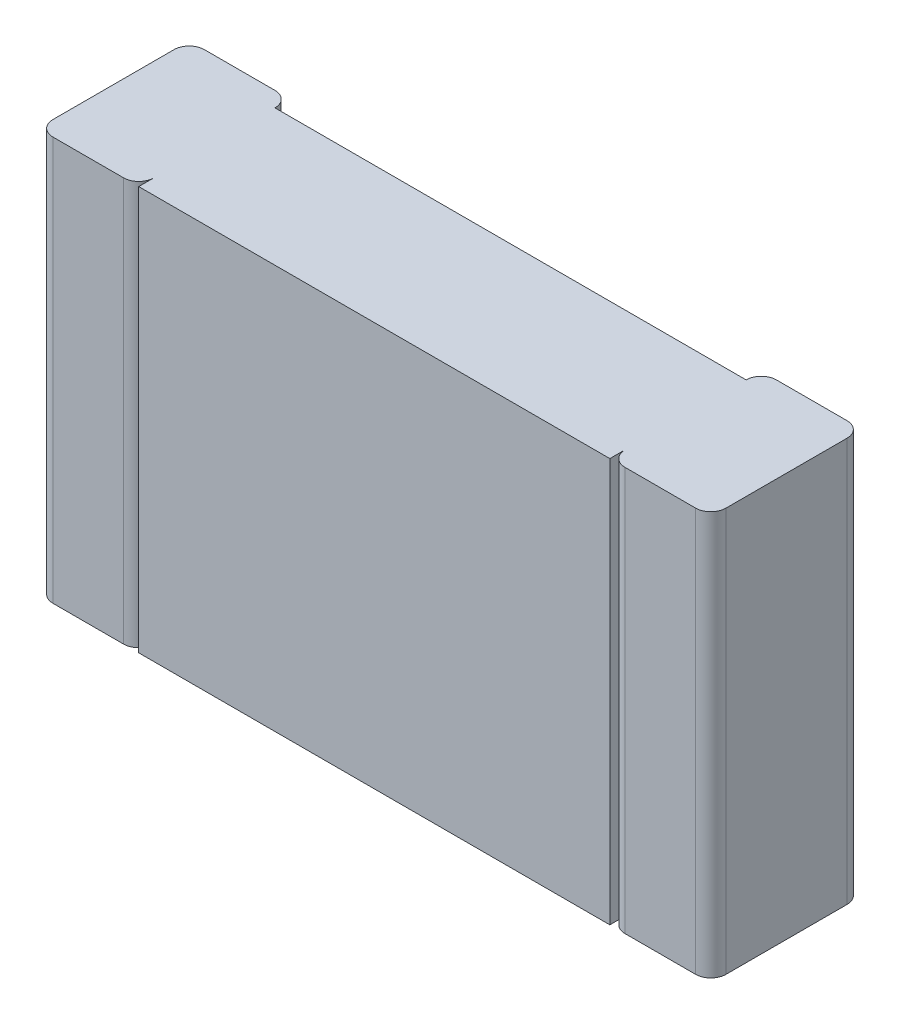
ISO-10303-21;
HEADER;
FILE_DESCRIPTION(('STEP AP214'),'2;1');
FILE_NAME('part.step','',(''),(''),'','','');
FILE_SCHEMA(('AUTOMOTIVE_DESIGN { 1 0 10303 214 1 1 1 1 }'));
ENDSEC;
DATA;
#1=APPLICATION_CONTEXT('core data for automotive mechanical design processes');
#2=APPLICATION_PROTOCOL_DEFINITION('international standard','automotive_design',2000,#1);
#3=PRODUCT_CONTEXT('',#1,'mechanical');
#4=PRODUCT('Part','Part','',(#3));
#5=PRODUCT_RELATED_PRODUCT_CATEGORY('part','',(#4));
#6=PRODUCT_DEFINITION_FORMATION('','',#4);
#7=PRODUCT_DEFINITION_CONTEXT('part definition',#1,'design');
#8=PRODUCT_DEFINITION('design','',#6,#7);
#9=PRODUCT_DEFINITION_SHAPE('','',#8);
#10=(LENGTH_UNIT() NAMED_UNIT(*) SI_UNIT(.MILLI.,.METRE.));
#11=(NAMED_UNIT(*) PLANE_ANGLE_UNIT() SI_UNIT($,.RADIAN.));
#12=(NAMED_UNIT(*) SI_UNIT($,.STERADIAN.) SOLID_ANGLE_UNIT());
#13=UNCERTAINTY_MEASURE_WITH_UNIT(LENGTH_MEASURE(1.E-05),#10,'distance_accuracy_value','');
#14=(GEOMETRIC_REPRESENTATION_CONTEXT(3) GLOBAL_UNCERTAINTY_ASSIGNED_CONTEXT((#13)) GLOBAL_UNIT_ASSIGNED_CONTEXT((#10,
#11,#12)) REPRESENTATION_CONTEXT('',''));
#15=CARTESIAN_POINT('',(0.,0.,0.));
#16=DIRECTION('',(0.,0.,1.));
#17=DIRECTION('',(1.,0.,0.));
#18=AXIS2_PLACEMENT_3D('',#15,#16,#17);
#19=CARTESIAN_POINT('',(-0.955,-0.6,0.045));
#20=DIRECTION('',(0.,1.,0.));
#21=DIRECTION('',(0.,0.,1.));
#22=AXIS2_PLACEMENT_3D('',#19,#20,#21);
#23=CYLINDRICAL_SURFACE('',#22,0.045);
#24=DIRECTION('',(0.,1.,0.));
#25=VECTOR('',#24,1.);
#26=CARTESIAN_POINT('',(-0.955,-0.6,0.));
#27=LINE('',#26,#25);
#28=CARTESIAN_POINT('',(-0.955,0.6,0.));
#29=VERTEX_POINT('',#28);
#30=CARTESIAN_POINT('',(-0.955,-0.6,0.));
#31=VERTEX_POINT('',#30);
#32=EDGE_CURVE('E129',#29,#31,#27,.F.);
#33=ORIENTED_EDGE('',*,*,#32,.T.);
#34=CARTESIAN_POINT('',(-0.955,-0.6,0.045));
#35=DIRECTION('',(0.,1.,0.));
#36=DIRECTION('',(0.,0.,1.));
#37=AXIS2_PLACEMENT_3D('',#34,#35,#36);
#38=CIRCLE('',#37,0.045);
#39=CARTESIAN_POINT('',(-1.,-0.6,0.045));
#40=VERTEX_POINT('',#39);
#41=EDGE_CURVE('E20',#31,#40,#38,.T.);
#42=ORIENTED_EDGE('',*,*,#41,.T.);
#43=DIRECTION('',(0.,1.,0.));
#44=VECTOR('',#43,1.);
#45=CARTESIAN_POINT('',(-1.,-0.6,0.045));
#46=LINE('',#45,#44);
#47=CARTESIAN_POINT('',(-1.,0.6,0.045));
#48=VERTEX_POINT('',#47);
#49=EDGE_CURVE('E136',#40,#48,#46,.T.);
#50=ORIENTED_EDGE('',*,*,#49,.T.);
#51=CARTESIAN_POINT('',(-0.955,0.6,0.045));
#52=DIRECTION('',(0.,1.,0.));
#53=DIRECTION('',(0.,0.,1.));
#54=AXIS2_PLACEMENT_3D('',#51,#52,#53);
#55=CIRCLE('',#54,0.045);
#56=EDGE_CURVE('E232',#29,#48,#55,.T.);
#57=ORIENTED_EDGE('',*,*,#56,.F.);
#58=EDGE_LOOP('',(#33,#42,#50,#57));
#59=FACE_BOUND('',#58,.T.);
#60=ADVANCED_FACE('F17',(#59),#23,.T.);
#61=CARTESIAN_POINT('',(-1.,-0.6,0.));
#62=DIRECTION('',(1.,0.,0.));
#63=DIRECTION('',(0.,0.,-1.));
#64=AXIS2_PLACEMENT_3D('',#61,#62,#63);
#65=PLANE('',#64);
#66=DIRECTION('',(0.,0.,1.));
#67=VECTOR('',#66,1.);
#68=CARTESIAN_POINT('',(-1.,0.6,0.));
#69=LINE('',#68,#67);
#70=CARTESIAN_POINT('',(-1.,0.6,0.405));
#71=VERTEX_POINT('',#70);
#72=EDGE_CURVE('E141',#48,#71,#69,.T.);
#73=ORIENTED_EDGE('',*,*,#72,.F.);
#74=ORIENTED_EDGE('',*,*,#49,.F.);
#75=DIRECTION('',(0.,0.,1.));
#76=VECTOR('',#75,1.);
#77=CARTESIAN_POINT('',(-1.,-0.6,0.));
#78=LINE('',#77,#76);
#79=CARTESIAN_POINT('',(-1.,-0.6,0.405));
#80=VERTEX_POINT('',#79);
#81=EDGE_CURVE('E140',#40,#80,#78,.T.);
#82=ORIENTED_EDGE('',*,*,#81,.T.);
#83=DIRECTION('',(0.,1.,0.));
#84=VECTOR('',#83,1.);
#85=CARTESIAN_POINT('',(-1.,-0.6,0.405));
#86=LINE('',#85,#84);
#87=EDGE_CURVE('E142',#71,#80,#86,.F.);
#88=ORIENTED_EDGE('',*,*,#87,.F.);
#89=EDGE_LOOP('',(#73,#74,#82,#88));
#90=FACE_BOUND('',#89,.T.);
#91=ADVANCED_FACE('F138',(#90),#65,.F.);
#92=CARTESIAN_POINT('',(-0.955,-0.6,0.405));
#93=DIRECTION('',(0.,1.,0.));
#94=DIRECTION('',(0.,0.,1.));
#95=AXIS2_PLACEMENT_3D('',#92,#93,#94);
#96=CYLINDRICAL_SURFACE('',#95,0.045);
#97=CARTESIAN_POINT('',(-0.955,0.6,0.405));
#98=DIRECTION('',(0.,1.,0.));
#99=DIRECTION('',(0.,0.,1.));
#100=AXIS2_PLACEMENT_3D('',#97,#98,#99);
#101=CIRCLE('',#100,0.045);
#102=CARTESIAN_POINT('',(-0.955,0.6,0.45));
#103=VERTEX_POINT('',#102);
#104=EDGE_CURVE('E230',#71,#103,#101,.T.);
#105=ORIENTED_EDGE('',*,*,#104,.F.);
#106=ORIENTED_EDGE('',*,*,#87,.T.);
#107=CARTESIAN_POINT('',(-0.955,-0.6,0.405));
#108=DIRECTION('',(0.,1.,0.));
#109=DIRECTION('',(0.,0.,1.));
#110=AXIS2_PLACEMENT_3D('',#107,#108,#109);
#111=CIRCLE('',#110,0.045);
#112=CARTESIAN_POINT('',(-0.955,-0.6,0.45));
#113=VERTEX_POINT('',#112);
#114=EDGE_CURVE('E151',#80,#113,#111,.T.);
#115=ORIENTED_EDGE('',*,*,#114,.T.);
#116=DIRECTION('',(0.,1.,0.));
#117=VECTOR('',#116,1.);
#118=CARTESIAN_POINT('',(-0.955,-0.6,0.45));
#119=LINE('',#118,#117);
#120=EDGE_CURVE('E200',#103,#113,#119,.F.);
#121=ORIENTED_EDGE('',*,*,#120,.F.);
#122=EDGE_LOOP('',(#105,#106,#115,#121));
#123=FACE_BOUND('',#122,.T.);
#124=ADVANCED_FACE('F456',(#123),#96,.T.);
#125=CARTESIAN_POINT('',(-1.,-0.6,0.45));
#126=DIRECTION('',(0.,0.,1.));
#127=DIRECTION('',(1.,0.,0.));
#128=AXIS2_PLACEMENT_3D('',#125,#126,#127);
#129=PLANE('',#128);
#130=DIRECTION('',(1.,0.,0.));
#131=VECTOR('',#130,1.);
#132=CARTESIAN_POINT('',(-1.,-0.6,0.45));
#133=LINE('',#132,#131);
#134=CARTESIAN_POINT('',(-0.745,-0.6,0.45));
#135=VERTEX_POINT('',#134);
#136=EDGE_CURVE('E248',#113,#135,#133,.T.);
#137=ORIENTED_EDGE('',*,*,#136,.T.);
#138=DIRECTION('',(0.,1.,0.));
#139=VECTOR('',#138,1.);
#140=CARTESIAN_POINT('',(-0.745,-0.6,0.45));
#141=LINE('',#140,#139);
#142=CARTESIAN_POINT('',(-0.745,0.6,0.45));
#143=VERTEX_POINT('',#142);
#144=EDGE_CURVE('E198',#143,#135,#141,.F.);
#145=ORIENTED_EDGE('',*,*,#144,.F.);
#146=DIRECTION('',(1.,0.,0.));
#147=VECTOR('',#146,1.);
#148=CARTESIAN_POINT('',(-1.,0.6,0.45));
#149=LINE('',#148,#147);
#150=EDGE_CURVE('E229',#103,#143,#149,.T.);
#151=ORIENTED_EDGE('',*,*,#150,.F.);
#152=ORIENTED_EDGE('',*,*,#120,.T.);
#153=EDGE_LOOP('',(#137,#145,#151,#152));
#154=FACE_BOUND('',#153,.T.);
#155=ADVANCED_FACE('F446',(#154),#129,.T.);
#156=CARTESIAN_POINT('',(-0.745,-0.6,0.405));
#157=DIRECTION('',(0.,1.,0.));
#158=DIRECTION('',(0.,0.,1.));
#159=AXIS2_PLACEMENT_3D('',#156,#157,#158);
#160=CYLINDRICAL_SURFACE('',#159,0.045);
#161=ORIENTED_EDGE('',*,*,#144,.T.);
#162=CARTESIAN_POINT('',(-0.745,-0.6,0.405));
#163=DIRECTION('',(0.,1.,0.));
#164=DIRECTION('',(0.,0.,1.));
#165=AXIS2_PLACEMENT_3D('',#162,#163,#164);
#166=CIRCLE('',#165,0.045);
#167=CARTESIAN_POINT('',(-0.7,-0.6,0.405));
#168=VERTEX_POINT('',#167);
#169=EDGE_CURVE('E246',#135,#168,#166,.T.);
#170=ORIENTED_EDGE('',*,*,#169,.T.);
#171=DIRECTION('',(0.,1.,0.));
#172=VECTOR('',#171,1.);
#173=CARTESIAN_POINT('',(-0.7,-0.6,0.405));
#174=LINE('',#173,#172);
#175=CARTESIAN_POINT('',(-0.7,0.6,0.405));
#176=VERTEX_POINT('',#175);
#177=EDGE_CURVE('E193',#168,#176,#174,.T.);
#178=ORIENTED_EDGE('',*,*,#177,.T.);
#179=CARTESIAN_POINT('',(-0.745,0.6,0.405));
#180=DIRECTION('',(0.,1.,0.));
#181=DIRECTION('',(0.,0.,1.));
#182=AXIS2_PLACEMENT_3D('',#179,#180,#181);
#183=CIRCLE('',#182,0.045);
#184=EDGE_CURVE('E227',#143,#176,#183,.T.);
#185=ORIENTED_EDGE('',*,*,#184,.F.);
#186=EDGE_LOOP('',(#161,#170,#178,#185));
#187=FACE_BOUND('',#186,.T.);
#188=ADVANCED_FACE('F434',(#187),#160,.T.);
#189=CARTESIAN_POINT('',(-0.7,-0.6,0.405));
#190=DIRECTION('',(1.,0.,0.));
#191=DIRECTION('',(0.,0.,-1.));
#192=AXIS2_PLACEMENT_3D('',#189,#190,#191);
#193=PLANE('',#192);
#194=DIRECTION('',(0.,0.,1.));
#195=VECTOR('',#194,1.);
#196=CARTESIAN_POINT('',(-0.7,0.6,0.405));
#197=LINE('',#196,#195);
#198=CARTESIAN_POINT('',(-0.7,0.6,0.45));
#199=VERTEX_POINT('',#198);
#200=EDGE_CURVE('E188',#176,#199,#197,.T.);
#201=ORIENTED_EDGE('',*,*,#200,.F.);
#202=ORIENTED_EDGE('',*,*,#177,.F.);
#203=DIRECTION('',(0.,0.,1.));
#204=VECTOR('',#203,1.);
#205=CARTESIAN_POINT('',(-0.7,-0.6,0.405));
#206=LINE('',#205,#204);
#207=CARTESIAN_POINT('',(-0.7,-0.6,0.45));
#208=VERTEX_POINT('',#207);
#209=EDGE_CURVE('E206',#168,#208,#206,.T.);
#210=ORIENTED_EDGE('',*,*,#209,.T.);
#211=DIRECTION('',(0.,1.,0.));
#212=VECTOR('',#211,1.);
#213=CARTESIAN_POINT('',(-0.7,-0.6,0.45));
#214=LINE('',#213,#212);
#215=EDGE_CURVE('E181',#199,#208,#214,.F.);
#216=ORIENTED_EDGE('',*,*,#215,.F.);
#217=EDGE_LOOP('',(#201,#202,#210,#216));
#218=FACE_BOUND('',#217,.T.);
#219=ADVANCED_FACE('F424',(#218),#193,.F.);
#220=CARTESIAN_POINT('',(-0.7,-0.6,0.45));
#221=DIRECTION('',(0.,0.,1.));
#222=DIRECTION('',(1.,0.,0.));
#223=AXIS2_PLACEMENT_3D('',#220,#221,#222);
#224=PLANE('',#223);
#225=DIRECTION('',(0.,1.,0.));
#226=VECTOR('',#225,1.);
#227=CARTESIAN_POINT('',(0.7,-0.6,0.45));
#228=LINE('',#227,#226);
#229=CARTESIAN_POINT('',(0.7,0.6,0.45));
#230=VERTEX_POINT('',#229);
#231=CARTESIAN_POINT('',(0.7,-0.6,0.45));
#232=VERTEX_POINT('',#231);
#233=EDGE_CURVE('E174',#230,#232,#228,.F.);
#234=ORIENTED_EDGE('',*,*,#233,.F.);
#235=DIRECTION('',(1.,0.,0.));
#236=VECTOR('',#235,1.);
#237=CARTESIAN_POINT('',(-0.7,0.6,0.45));
#238=LINE('',#237,#236);
#239=EDGE_CURVE('E184',#199,#230,#238,.T.);
#240=ORIENTED_EDGE('',*,*,#239,.F.);
#241=ORIENTED_EDGE('',*,*,#215,.T.);
#242=DIRECTION('',(1.,0.,0.));
#243=VECTOR('',#242,1.);
#244=CARTESIAN_POINT('',(-0.7,-0.6,0.45));
#245=LINE('',#244,#243);
#246=EDGE_CURVE('E203',#208,#232,#245,.T.);
#247=ORIENTED_EDGE('',*,*,#246,.T.);
#248=EDGE_LOOP('',(#234,#240,#241,#247));
#249=FACE_BOUND('',#248,.T.);
#250=ADVANCED_FACE('F411',(#249),#224,.T.);
#251=CARTESIAN_POINT('',(0.7,-0.6,0.405));
#252=DIRECTION('',(1.,0.,0.));
#253=DIRECTION('',(0.,0.,-1.));
#254=AXIS2_PLACEMENT_3D('',#251,#252,#253);
#255=PLANE('',#254);
#256=DIRECTION('',(0.,0.,1.));
#257=VECTOR('',#256,1.);
#258=CARTESIAN_POINT('',(0.7,0.6,0.405));
#259=LINE('',#258,#257);
#260=CARTESIAN_POINT('',(0.7,0.6,0.405));
#261=VERTEX_POINT('',#260);
#262=EDGE_CURVE('E187',#230,#261,#259,.F.);
#263=ORIENTED_EDGE('',*,*,#262,.F.);
#264=ORIENTED_EDGE('',*,*,#233,.T.);
#265=DIRECTION('',(0.,0.,1.));
#266=VECTOR('',#265,1.);
#267=CARTESIAN_POINT('',(0.7,-0.6,0.405));
#268=LINE('',#267,#266);
#269=CARTESIAN_POINT('',(0.7,-0.6,0.405));
#270=VERTEX_POINT('',#269);
#271=EDGE_CURVE('E178',#232,#270,#268,.F.);
#272=ORIENTED_EDGE('',*,*,#271,.T.);
#273=DIRECTION('',(0.,1.,0.));
#274=VECTOR('',#273,1.);
#275=CARTESIAN_POINT('',(0.7,-0.6,0.405));
#276=LINE('',#275,#274);
#277=EDGE_CURVE('E172',#261,#270,#276,.F.);
#278=ORIENTED_EDGE('',*,*,#277,.F.);
#279=EDGE_LOOP('',(#263,#264,#272,#278));
#280=FACE_BOUND('',#279,.T.);
#281=ADVANCED_FACE('F375',(#280),#255,.T.);
#282=CARTESIAN_POINT('',(0.745,-0.6,0.405));
#283=DIRECTION('',(0.,1.,0.));
#284=DIRECTION('',(0.,0.,1.));
#285=AXIS2_PLACEMENT_3D('',#282,#283,#284);
#286=CYLINDRICAL_SURFACE('',#285,0.045);
#287=CARTESIAN_POINT('',(0.745,0.6,0.405));
#288=DIRECTION('',(0.,1.,0.));
#289=DIRECTION('',(0.,0.,1.));
#290=AXIS2_PLACEMENT_3D('',#287,#288,#289);
#291=CIRCLE('',#290,0.045);
#292=CARTESIAN_POINT('',(0.745,0.6,0.45));
#293=VERTEX_POINT('',#292);
#294=EDGE_CURVE('E224',#261,#293,#291,.T.);
#295=ORIENTED_EDGE('',*,*,#294,.F.);
#296=ORIENTED_EDGE('',*,*,#277,.T.);
#297=CARTESIAN_POINT('',(0.745,-0.6,0.405));
#298=DIRECTION('',(0.,1.,0.));
#299=DIRECTION('',(0.,0.,1.));
#300=AXIS2_PLACEMENT_3D('',#297,#298,#299);
#301=CIRCLE('',#300,0.045);
#302=CARTESIAN_POINT('',(0.745,-0.6,0.45));
#303=VERTEX_POINT('',#302);
#304=EDGE_CURVE('E243',#270,#303,#301,.T.);
#305=ORIENTED_EDGE('',*,*,#304,.T.);
#306=DIRECTION('',(0.,1.,0.));
#307=VECTOR('',#306,1.);
#308=CARTESIAN_POINT('',(0.745,-0.6,0.45));
#309=LINE('',#308,#307);
#310=EDGE_CURVE('E170',#293,#303,#309,.F.);
#311=ORIENTED_EDGE('',*,*,#310,.F.);
#312=EDGE_LOOP('',(#295,#296,#305,#311));
#313=FACE_BOUND('',#312,.T.);
#314=ADVANCED_FACE('F410',(#313),#286,.T.);
#315=CARTESIAN_POINT('',(0.7,-0.6,0.45));
#316=DIRECTION('',(0.,0.,1.));
#317=DIRECTION('',(1.,0.,0.));
#318=AXIS2_PLACEMENT_3D('',#315,#316,#317);
#319=PLANE('',#318);
#320=DIRECTION('',(1.,0.,0.));
#321=VECTOR('',#320,1.);
#322=CARTESIAN_POINT('',(0.7,-0.6,0.45));
#323=LINE('',#322,#321);
#324=CARTESIAN_POINT('',(0.955,-0.6,0.45));
#325=VERTEX_POINT('',#324);
#326=EDGE_CURVE('E242',#303,#325,#323,.T.);
#327=ORIENTED_EDGE('',*,*,#326,.T.);
#328=DIRECTION('',(0.,1.,0.));
#329=VECTOR('',#328,1.);
#330=CARTESIAN_POINT('',(0.955,-0.6,0.45));
#331=LINE('',#330,#329);
#332=CARTESIAN_POINT('',(0.955,0.6,0.45));
#333=VERTEX_POINT('',#332);
#334=EDGE_CURVE('E168',#333,#325,#331,.F.);
#335=ORIENTED_EDGE('',*,*,#334,.F.);
#336=DIRECTION('',(1.,0.,0.));
#337=VECTOR('',#336,1.);
#338=CARTESIAN_POINT('',(0.7,0.6,0.45));
#339=LINE('',#338,#337);
#340=EDGE_CURVE('E223',#293,#333,#339,.T.);
#341=ORIENTED_EDGE('',*,*,#340,.F.);
#342=ORIENTED_EDGE('',*,*,#310,.T.);
#343=EDGE_LOOP('',(#327,#335,#341,#342));
#344=FACE_BOUND('',#343,.T.);
#345=ADVANCED_FACE('F487',(#344),#319,.T.);
#346=CARTESIAN_POINT('',(0.955,-0.6,0.405));
#347=DIRECTION('',(0.,1.,0.));
#348=DIRECTION('',(0.,0.,1.));
#349=AXIS2_PLACEMENT_3D('',#346,#347,#348);
#350=CYLINDRICAL_SURFACE('',#349,0.045);
#351=ORIENTED_EDGE('',*,*,#334,.T.);
#352=CARTESIAN_POINT('',(0.955,-0.6,0.405));
#353=DIRECTION('',(0.,1.,0.));
#354=DIRECTION('',(0.,0.,1.));
#355=AXIS2_PLACEMENT_3D('',#352,#353,#354);
#356=CIRCLE('',#355,0.045);
#357=CARTESIAN_POINT('',(1.,-0.6,0.405));
#358=VERTEX_POINT('',#357);
#359=EDGE_CURVE('E239',#325,#358,#356,.T.);
#360=ORIENTED_EDGE('',*,*,#359,.T.);
#361=DIRECTION('',(0.,1.,0.));
#362=VECTOR('',#361,1.);
#363=CARTESIAN_POINT('',(1.,-0.6,0.405));
#364=LINE('',#363,#362);
#365=CARTESIAN_POINT('',(1.,0.6,0.405));
#366=VERTEX_POINT('',#365);
#367=EDGE_CURVE('E166',#366,#358,#364,.F.);
#368=ORIENTED_EDGE('',*,*,#367,.F.);
#369=CARTESIAN_POINT('',(0.955,0.6,0.405));
#370=DIRECTION('',(0.,1.,0.));
#371=DIRECTION('',(0.,0.,1.));
#372=AXIS2_PLACEMENT_3D('',#369,#370,#371);
#373=CIRCLE('',#372,0.045);
#374=EDGE_CURVE('E221',#333,#366,#373,.T.);
#375=ORIENTED_EDGE('',*,*,#374,.F.);
#376=EDGE_LOOP('',(#351,#360,#368,#375));
#377=FACE_BOUND('',#376,.T.);
#378=ADVANCED_FACE('F491',(#377),#350,.T.);
#379=CARTESIAN_POINT('',(1.,-0.6,0.));
#380=DIRECTION('',(1.,0.,0.));
#381=DIRECTION('',(0.,0.,-1.));
#382=AXIS2_PLACEMENT_3D('',#379,#380,#381);
#383=PLANE('',#382);
#384=DIRECTION('',(0.,0.,1.));
#385=VECTOR('',#384,1.);
#386=CARTESIAN_POINT('',(1.,0.6,0.));
#387=LINE('',#386,#385);
#388=CARTESIAN_POINT('',(1.,0.6,0.045));
#389=VERTEX_POINT('',#388);
#390=EDGE_CURVE('E220',#366,#389,#387,.F.);
#391=ORIENTED_EDGE('',*,*,#390,.F.);
#392=ORIENTED_EDGE('',*,*,#367,.T.);
#393=DIRECTION('',(0.,0.,1.));
#394=VECTOR('',#393,1.);
#395=CARTESIAN_POINT('',(1.,-0.6,0.));
#396=LINE('',#395,#394);
#397=CARTESIAN_POINT('',(1.,-0.6,0.045));
#398=VERTEX_POINT('',#397);
#399=EDGE_CURVE('E238',#358,#398,#396,.F.);
#400=ORIENTED_EDGE('',*,*,#399,.T.);
#401=DIRECTION('',(0.,1.,0.));
#402=VECTOR('',#401,1.);
#403=CARTESIAN_POINT('',(1.,-0.6,0.045));
#404=LINE('',#403,#402);
#405=EDGE_CURVE('E157',#389,#398,#404,.F.);
#406=ORIENTED_EDGE('',*,*,#405,.F.);
#407=EDGE_LOOP('',(#391,#392,#400,#406));
#408=FACE_BOUND('',#407,.T.);
#409=ADVANCED_FACE('F298',(#408),#383,.T.);
#410=CARTESIAN_POINT('',(0.955,-0.6,0.045));
#411=DIRECTION('',(0.,1.,0.));
#412=DIRECTION('',(0.,0.,1.));
#413=AXIS2_PLACEMENT_3D('',#410,#411,#412);
#414=CYLINDRICAL_SURFACE('',#413,0.045);
#415=CARTESIAN_POINT('',(0.955,0.6,0.045));
#416=DIRECTION('',(0.,1.,0.));
#417=DIRECTION('',(0.,0.,1.));
#418=AXIS2_PLACEMENT_3D('',#415,#416,#417);
#419=CIRCLE('',#418,0.045);
#420=CARTESIAN_POINT('',(0.955,0.6,0.));
#421=VERTEX_POINT('',#420);
#422=EDGE_CURVE('E217',#389,#421,#419,.T.);
#423=ORIENTED_EDGE('',*,*,#422,.F.);
#424=ORIENTED_EDGE('',*,*,#405,.T.);
#425=CARTESIAN_POINT('',(0.955,-0.6,0.045));
#426=DIRECTION('',(0.,1.,0.));
#427=DIRECTION('',(0.,0.,1.));
#428=AXIS2_PLACEMENT_3D('',#425,#426,#427);
#429=CIRCLE('',#428,0.045);
#430=CARTESIAN_POINT('',(0.955,-0.6,0.));
#431=VERTEX_POINT('',#430);
#432=EDGE_CURVE('E235',#398,#431,#429,.T.);
#433=ORIENTED_EDGE('',*,*,#432,.T.);
#434=DIRECTION('',(0.,1.,0.));
#435=VECTOR('',#434,1.);
#436=CARTESIAN_POINT('',(0.955,-0.6,0.));
#437=LINE('',#436,#435);
#438=EDGE_CURVE('E175',#431,#421,#437,.T.);
#439=ORIENTED_EDGE('',*,*,#438,.T.);
#440=EDGE_LOOP('',(#423,#424,#433,#439));
#441=FACE_BOUND('',#440,.T.);
#442=ADVANCED_FACE('F302',(#441),#414,.T.);
#443=CARTESIAN_POINT('',(-1.,-0.6,0.));
#444=DIRECTION('',(0.,0.,1.));
#445=DIRECTION('',(1.,0.,0.));
#446=AXIS2_PLACEMENT_3D('',#443,#444,#445);
#447=PLANE('',#446);
#448=DIRECTION('',(1.,0.,0.));
#449=VECTOR('',#448,1.);
#450=CARTESIAN_POINT('',(-1.,-0.6,0.));
#451=LINE('',#450,#449);
#452=CARTESIAN_POINT('',(-0.745,-0.6,0.));
#453=VERTEX_POINT('',#452);
#454=EDGE_CURVE('E153',#453,#31,#451,.F.);
#455=ORIENTED_EDGE('',*,*,#454,.T.);
#456=ORIENTED_EDGE('',*,*,#32,.F.);
#457=DIRECTION('',(1.,0.,0.));
#458=VECTOR('',#457,1.);
#459=CARTESIAN_POINT('',(-1.,0.6,0.));
#460=LINE('',#459,#458);
#461=CARTESIAN_POINT('',(-0.745,0.6,0.));
#462=VERTEX_POINT('',#461);
#463=EDGE_CURVE('E234',#462,#29,#460,.F.);
#464=ORIENTED_EDGE('',*,*,#463,.F.);
#465=DIRECTION('',(0.,1.,0.));
#466=VECTOR('',#465,1.);
#467=CARTESIAN_POINT('',(-0.745,-0.6,0.));
#468=LINE('',#467,#466);
#469=EDGE_CURVE('E161',#453,#462,#468,.T.);
#470=ORIENTED_EDGE('',*,*,#469,.F.);
#471=EDGE_LOOP('',(#455,#456,#464,#470));
#472=FACE_BOUND('',#471,.T.);
#473=ADVANCED_FACE('F319',(#472),#447,.F.);
#474=CARTESIAN_POINT('',(0.7,-0.6,0.));
#475=DIRECTION('',(0.,0.,1.));
#476=DIRECTION('',(1.,0.,0.));
#477=AXIS2_PLACEMENT_3D('',#474,#475,#476);
#478=PLANE('',#477);
#479=DIRECTION('',(1.,0.,0.));
#480=VECTOR('',#479,1.);
#481=CARTESIAN_POINT('',(0.7,-0.6,0.));
#482=LINE('',#481,#480);
#483=CARTESIAN_POINT('',(0.745,-0.6,0.));
#484=VERTEX_POINT('',#483);
#485=EDGE_CURVE('E177',#431,#484,#482,.F.);
#486=ORIENTED_EDGE('',*,*,#485,.T.);
#487=DIRECTION('',(0.,1.,0.));
#488=VECTOR('',#487,1.);
#489=CARTESIAN_POINT('',(0.745,-0.6,0.));
#490=LINE('',#489,#488);
#491=CARTESIAN_POINT('',(0.745,0.6,0.));
#492=VERTEX_POINT('',#491);
#493=EDGE_CURVE('E212',#492,#484,#490,.F.);
#494=ORIENTED_EDGE('',*,*,#493,.F.);
#495=DIRECTION('',(1.,0.,0.));
#496=VECTOR('',#495,1.);
#497=CARTESIAN_POINT('',(0.7,0.6,0.));
#498=LINE('',#497,#496);
#499=EDGE_CURVE('E226',#421,#492,#498,.F.);
#500=ORIENTED_EDGE('',*,*,#499,.F.);
#501=ORIENTED_EDGE('',*,*,#438,.F.);
#502=EDGE_LOOP('',(#486,#494,#500,#501));
#503=FACE_BOUND('',#502,.T.);
#504=ADVANCED_FACE('F305',(#503),#478,.F.);
#505=CARTESIAN_POINT('',(-0.745,-0.6,0.045));
#506=DIRECTION('',(0.,1.,0.));
#507=DIRECTION('',(0.,0.,1.));
#508=AXIS2_PLACEMENT_3D('',#505,#506,#507);
#509=CYLINDRICAL_SURFACE('',#508,0.045);
#510=CARTESIAN_POINT('',(-0.745,0.6,0.045));
#511=DIRECTION('',(0.,1.,0.));
#512=DIRECTION('',(0.,0.,1.));
#513=AXIS2_PLACEMENT_3D('',#510,#511,#512);
#514=CIRCLE('',#513,0.045);
#515=CARTESIAN_POINT('',(-0.7,0.6,0.045));
#516=VERTEX_POINT('',#515);
#517=EDGE_CURVE('E163',#462,#516,#514,.F.);
#518=ORIENTED_EDGE('',*,*,#517,.T.);
#519=DIRECTION('',(0.,1.,0.));
#520=VECTOR('',#519,1.);
#521=CARTESIAN_POINT('',(-0.7,-0.6,0.045));
#522=LINE('',#521,#520);
#523=CARTESIAN_POINT('',(-0.7,-0.6,0.045));
#524=VERTEX_POINT('',#523);
#525=EDGE_CURVE('E211',#516,#524,#522,.F.);
#526=ORIENTED_EDGE('',*,*,#525,.T.);
#527=CARTESIAN_POINT('',(-0.745,-0.6,0.045));
#528=DIRECTION('',(0.,1.,0.));
#529=DIRECTION('',(0.,0.,1.));
#530=AXIS2_PLACEMENT_3D('',#527,#528,#529);
#531=CIRCLE('',#530,0.045);
#532=EDGE_CURVE('E164',#524,#453,#531,.T.);
#533=ORIENTED_EDGE('',*,*,#532,.T.);
#534=ORIENTED_EDGE('',*,*,#469,.T.);
#535=EDGE_LOOP('',(#518,#526,#533,#534));
#536=FACE_BOUND('',#535,.T.);
#537=ADVANCED_FACE('F318',(#536),#509,.T.);
#538=CARTESIAN_POINT('',(-0.955,-0.6,0.045));
#539=DIRECTION('',(0.,1.,0.));
#540=DIRECTION('',(0.,0.,1.));
#541=AXIS2_PLACEMENT_3D('',#538,#539,#540);
#542=PLANE('',#541);
#543=DIRECTION('',(1.,0.,0.));
#544=VECTOR('',#543,1.);
#545=CARTESIAN_POINT('',(-0.955,-0.6,0.045));
#546=LINE('',#545,#544);
#547=CARTESIAN_POINT('',(0.7,-0.6,0.045));
#548=VERTEX_POINT('',#547);
#549=EDGE_CURVE('E263',#524,#548,#546,.T.);
#550=ORIENTED_EDGE('',*,*,#549,.T.);
#551=CARTESIAN_POINT('',(0.745,-0.6,0.045));
#552=DIRECTION('',(0.,1.,0.));
#553=DIRECTION('',(0.,0.,1.));
#554=AXIS2_PLACEMENT_3D('',#551,#552,#553);
#555=CIRCLE('',#554,0.045);
#556=EDGE_CURVE('E209',#484,#548,#555,.T.);
#557=ORIENTED_EDGE('',*,*,#556,.F.);
#558=ORIENTED_EDGE('',*,*,#485,.F.);
#559=ORIENTED_EDGE('',*,*,#432,.F.);
#560=ORIENTED_EDGE('',*,*,#399,.F.);
#561=ORIENTED_EDGE('',*,*,#359,.F.);
#562=ORIENTED_EDGE('',*,*,#326,.F.);
#563=ORIENTED_EDGE('',*,*,#304,.F.);
#564=ORIENTED_EDGE('',*,*,#271,.F.);
#565=ORIENTED_EDGE('',*,*,#246,.F.);
#566=ORIENTED_EDGE('',*,*,#209,.F.);
#567=ORIENTED_EDGE('',*,*,#169,.F.);
#568=ORIENTED_EDGE('',*,*,#136,.F.);
#569=ORIENTED_EDGE('',*,*,#114,.F.);
#570=ORIENTED_EDGE('',*,*,#81,.F.);
#571=ORIENTED_EDGE('',*,*,#41,.F.);
#572=ORIENTED_EDGE('',*,*,#454,.F.);
#573=ORIENTED_EDGE('',*,*,#532,.F.);
#574=EDGE_LOOP('',(#550,#557,#558,#559,#560,#561,#562,#563,#564,#565,#566,#567,#568,#569,#570,
#571,#572,#573));
#575=FACE_BOUND('',#574,.T.);
#576=ADVANCED_FACE('F147',(#575),#542,.F.);
#577=CARTESIAN_POINT('',(0.745,-0.6,0.045));
#578=DIRECTION('',(0.,1.,0.));
#579=DIRECTION('',(0.,0.,1.));
#580=AXIS2_PLACEMENT_3D('',#577,#578,#579);
#581=CYLINDRICAL_SURFACE('',#580,0.045);
#582=ORIENTED_EDGE('',*,*,#493,.T.);
#583=ORIENTED_EDGE('',*,*,#556,.T.);
#584=DIRECTION('',(0.,1.,0.));
#585=VECTOR('',#584,1.);
#586=CARTESIAN_POINT('',(0.7,-0.6,0.045));
#587=LINE('',#586,#585);
#588=CARTESIAN_POINT('',(0.7,0.6,0.045));
#589=VERTEX_POINT('',#588);
#590=EDGE_CURVE('E26',#548,#589,#587,.T.);
#591=ORIENTED_EDGE('',*,*,#590,.T.);
#592=CARTESIAN_POINT('',(0.745,0.6,0.045));
#593=DIRECTION('',(0.,1.,0.));
#594=DIRECTION('',(0.,0.,1.));
#595=AXIS2_PLACEMENT_3D('',#592,#593,#594);
#596=CIRCLE('',#595,0.045);
#597=EDGE_CURVE('E34',#589,#492,#596,.F.);
#598=ORIENTED_EDGE('',*,*,#597,.T.);
#599=EDGE_LOOP('',(#582,#583,#591,#598));
#600=FACE_BOUND('',#599,.T.);
#601=ADVANCED_FACE('F311',(#600),#581,.T.);
#602=CARTESIAN_POINT('',(-0.955,0.6,0.045));
#603=DIRECTION('',(0.,1.,0.));
#604=DIRECTION('',(0.,0.,1.));
#605=AXIS2_PLACEMENT_3D('',#602,#603,#604);
#606=PLANE('',#605);
#607=DIRECTION('',(1.,0.,0.));
#608=VECTOR('',#607,1.);
#609=CARTESIAN_POINT('',(-0.955,0.6,0.045));
#610=LINE('',#609,#608);
#611=EDGE_CURVE('E11',#589,#516,#610,.F.);
#612=ORIENTED_EDGE('',*,*,#611,.T.);
#613=ORIENTED_EDGE('',*,*,#517,.F.);
#614=ORIENTED_EDGE('',*,*,#463,.T.);
#615=ORIENTED_EDGE('',*,*,#56,.T.);
#616=ORIENTED_EDGE('',*,*,#72,.T.);
#617=ORIENTED_EDGE('',*,*,#104,.T.);
#618=ORIENTED_EDGE('',*,*,#150,.T.);
#619=ORIENTED_EDGE('',*,*,#184,.T.);
#620=ORIENTED_EDGE('',*,*,#200,.T.);
#621=ORIENTED_EDGE('',*,*,#239,.T.);
#622=ORIENTED_EDGE('',*,*,#262,.T.);
#623=ORIENTED_EDGE('',*,*,#294,.T.);
#624=ORIENTED_EDGE('',*,*,#340,.T.);
#625=ORIENTED_EDGE('',*,*,#374,.T.);
#626=ORIENTED_EDGE('',*,*,#390,.T.);
#627=ORIENTED_EDGE('',*,*,#422,.T.);
#628=ORIENTED_EDGE('',*,*,#499,.T.);
#629=ORIENTED_EDGE('',*,*,#597,.F.);
#630=EDGE_LOOP('',(#612,#613,#614,#615,#616,#617,#618,#619,#620,#621,#622,#623,#624,#625,#626,
#627,#628,#629));
#631=FACE_BOUND('',#630,.T.);
#632=ADVANCED_FACE('F292',(#631),#606,.T.);
#633=CARTESIAN_POINT('',(-0.955,-0.6,0.045));
#634=DIRECTION('',(0.,0.,1.));
#635=DIRECTION('',(1.,0.,0.));
#636=AXIS2_PLACEMENT_3D('',#633,#634,#635);
#637=PLANE('',#636);
#638=ORIENTED_EDGE('',*,*,#590,.F.);
#639=ORIENTED_EDGE('',*,*,#549,.F.);
#640=ORIENTED_EDGE('',*,*,#525,.F.);
#641=ORIENTED_EDGE('',*,*,#611,.F.);
#642=EDGE_LOOP('',(#638,#639,#640,#641));
#643=FACE_BOUND('',#642,.T.);
#644=ADVANCED_FACE('F313',(#643),#637,.F.);
#645=CLOSED_SHELL('',(#60,#91,#124,#155,#188,#219,#250,#281,#314,#345,#378,#409,#442,#473,#504,
#537,#576,#601,#632,#644));
#646=MANIFOLD_SOLID_BREP('B1',#645);
#647=ADVANCED_BREP_SHAPE_REPRESENTATION('',(#18,#646),#14);
#648=SHAPE_DEFINITION_REPRESENTATION(#9,#647);
ENDSEC;
END-ISO-10303-21;
